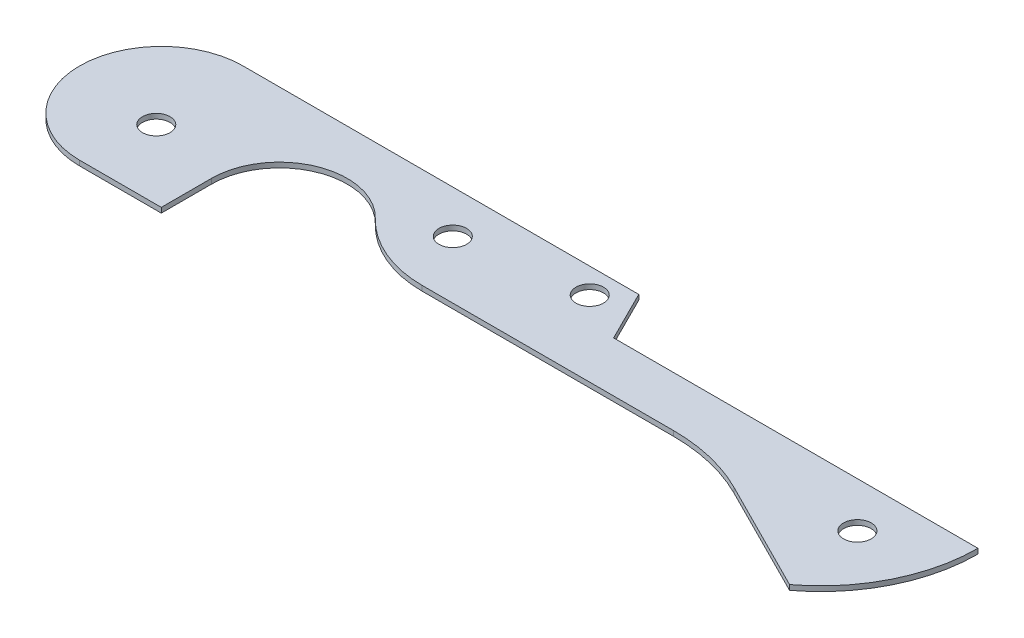
ISO-10303-21;
HEADER;
FILE_DESCRIPTION(('STEP AP214'),'2;1');
FILE_NAME('part.step','',(''),(''),'','','');
FILE_SCHEMA(('AUTOMOTIVE_DESIGN { 1 0 10303 214 1 1 1 1 }'));
ENDSEC;
DATA;
#1=APPLICATION_CONTEXT('core data for automotive mechanical design processes');
#2=APPLICATION_PROTOCOL_DEFINITION('international standard','automotive_design',2000,#1);
#3=PRODUCT_CONTEXT('',#1,'mechanical');
#4=PRODUCT('Part','Part','',(#3));
#5=PRODUCT_RELATED_PRODUCT_CATEGORY('part','',(#4));
#6=PRODUCT_DEFINITION_FORMATION('','',#4);
#7=PRODUCT_DEFINITION_CONTEXT('part definition',#1,'design');
#8=PRODUCT_DEFINITION('design','',#6,#7);
#9=PRODUCT_DEFINITION_SHAPE('','',#8);
#10=(LENGTH_UNIT() NAMED_UNIT(*) SI_UNIT(.MILLI.,.METRE.));
#11=(NAMED_UNIT(*) PLANE_ANGLE_UNIT() SI_UNIT($,.RADIAN.));
#12=(NAMED_UNIT(*) SI_UNIT($,.STERADIAN.) SOLID_ANGLE_UNIT());
#13=UNCERTAINTY_MEASURE_WITH_UNIT(LENGTH_MEASURE(1.E-05),#10,'distance_accuracy_value','');
#14=(GEOMETRIC_REPRESENTATION_CONTEXT(3) GLOBAL_UNCERTAINTY_ASSIGNED_CONTEXT((#13)) GLOBAL_UNIT_ASSIGNED_CONTEXT((#10,
#11,#12)) REPRESENTATION_CONTEXT('',''));
#15=CARTESIAN_POINT('',(0.,0.,0.));
#16=DIRECTION('',(0.,0.,1.));
#17=DIRECTION('',(1.,0.,0.));
#18=AXIS2_PLACEMENT_3D('',#15,#16,#17);
#19=CARTESIAN_POINT('',(0.,0.508,0.));
#20=DIRECTION('',(0.,-1.,0.));
#21=DIRECTION('',(0.,0.,-1.));
#22=AXIS2_PLACEMENT_3D('',#19,#20,#21);
#23=CYLINDRICAL_SURFACE('',#22,8.255);
#24=CARTESIAN_POINT('',(0.,0.,0.));
#25=DIRECTION('',(0.,1.,0.));
#26=DIRECTION('',(0.,0.,1.));
#27=AXIS2_PLACEMENT_3D('',#24,#25,#26);
#28=CIRCLE('',#27,8.255);
#29=CARTESIAN_POINT('',(0.,0.,-8.255));
#30=VERTEX_POINT('',#29);
#31=CARTESIAN_POINT('',(0.,0.,8.255));
#32=VERTEX_POINT('',#31);
#33=EDGE_CURVE('E168',#30,#32,#28,.T.);
#34=ORIENTED_EDGE('',*,*,#33,.T.);
#35=DIRECTION('',(0.,-1.,0.));
#36=VECTOR('',#35,1.);
#37=CARTESIAN_POINT('',(0.,0.508,8.255));
#38=LINE('',#37,#36);
#39=CARTESIAN_POINT('',(0.,0.508,8.255));
#40=VERTEX_POINT('',#39);
#41=EDGE_CURVE('E11',#40,#32,#38,.T.);
#42=ORIENTED_EDGE('',*,*,#41,.F.);
#43=CARTESIAN_POINT('',(0.,0.508,0.));
#44=DIRECTION('',(0.,1.,0.));
#45=DIRECTION('',(0.,0.,1.));
#46=AXIS2_PLACEMENT_3D('',#43,#44,#45);
#47=CIRCLE('',#46,8.255);
#48=CARTESIAN_POINT('',(0.,0.508,-8.255));
#49=VERTEX_POINT('',#48);
#50=EDGE_CURVE('E203',#49,#40,#47,.T.);
#51=ORIENTED_EDGE('',*,*,#50,.F.);
#52=DIRECTION('',(0.,-1.,0.));
#53=VECTOR('',#52,1.);
#54=CARTESIAN_POINT('',(0.,0.508,-8.255));
#55=LINE('',#54,#53);
#56=EDGE_CURVE('E164',#49,#30,#55,.T.);
#57=ORIENTED_EDGE('',*,*,#56,.T.);
#58=EDGE_LOOP('',(#34,#42,#51,#57));
#59=FACE_BOUND('',#58,.T.);
#60=ADVANCED_FACE('F42',(#59),#23,.T.);
#61=CARTESIAN_POINT('',(0.,0.508,8.255));
#62=DIRECTION('',(0.,0.,-1.));
#63=DIRECTION('',(-1.,0.,0.));
#64=AXIS2_PLACEMENT_3D('',#61,#62,#63);
#65=PLANE('',#64);
#66=DIRECTION('',(1.,0.,0.));
#67=VECTOR('',#66,1.);
#68=CARTESIAN_POINT('',(0.,0.,8.255));
#69=LINE('',#68,#67);
#70=CARTESIAN_POINT('',(8.255,0.,8.255));
#71=VERTEX_POINT('',#70);
#72=EDGE_CURVE('E172',#32,#71,#69,.T.);
#73=ORIENTED_EDGE('',*,*,#72,.T.);
#74=DIRECTION('',(0.,-1.,0.));
#75=VECTOR('',#74,1.);
#76=CARTESIAN_POINT('',(8.255,0.508,8.255));
#77=LINE('',#76,#75);
#78=CARTESIAN_POINT('',(8.255,0.508,8.255));
#79=VERTEX_POINT('',#78);
#80=EDGE_CURVE('E51',#79,#71,#77,.T.);
#81=ORIENTED_EDGE('',*,*,#80,.F.);
#82=DIRECTION('',(1.,0.,0.));
#83=VECTOR('',#82,1.);
#84=CARTESIAN_POINT('',(0.,0.508,8.255));
#85=LINE('',#84,#83);
#86=EDGE_CURVE('E114',#40,#79,#85,.T.);
#87=ORIENTED_EDGE('',*,*,#86,.F.);
#88=ORIENTED_EDGE('',*,*,#41,.T.);
#89=EDGE_LOOP('',(#73,#81,#87,#88));
#90=FACE_BOUND('',#89,.T.);
#91=ADVANCED_FACE('F305',(#90),#65,.F.);
#92=CARTESIAN_POINT('',(8.255,0.508,3.175));
#93=DIRECTION('',(-1.,0.,0.));
#94=DIRECTION('',(0.,0.,1.));
#95=AXIS2_PLACEMENT_3D('',#92,#93,#94);
#96=PLANE('',#95);
#97=DIRECTION('',(0.,0.,-1.));
#98=VECTOR('',#97,1.);
#99=CARTESIAN_POINT('',(8.255,0.,3.175));
#100=LINE('',#99,#98);
#101=CARTESIAN_POINT('',(8.255,0.,3.175));
#102=VERTEX_POINT('',#101);
#103=EDGE_CURVE('E176',#71,#102,#100,.T.);
#104=ORIENTED_EDGE('',*,*,#103,.T.);
#105=DIRECTION('',(0.,-1.,0.));
#106=VECTOR('',#105,1.);
#107=CARTESIAN_POINT('',(8.255,0.508,3.175));
#108=LINE('',#107,#106);
#109=CARTESIAN_POINT('',(8.255,0.508,3.175));
#110=VERTEX_POINT('',#109);
#111=EDGE_CURVE('E230',#110,#102,#108,.T.);
#112=ORIENTED_EDGE('',*,*,#111,.F.);
#113=DIRECTION('',(0.,0.,-1.));
#114=VECTOR('',#113,1.);
#115=CARTESIAN_POINT('',(8.255,0.508,3.175));
#116=LINE('',#115,#114);
#117=EDGE_CURVE('E241',#79,#110,#116,.T.);
#118=ORIENTED_EDGE('',*,*,#117,.F.);
#119=ORIENTED_EDGE('',*,*,#80,.T.);
#120=EDGE_LOOP('',(#104,#112,#118,#119));
#121=FACE_BOUND('',#120,.T.);
#122=ADVANCED_FACE('F239',(#121),#96,.F.);
#123=CARTESIAN_POINT('',(15.1129999999941,0.508,3.175));
#124=DIRECTION('',(0.,-1.,0.));
#125=DIRECTION('',(0.,0.,-1.));
#126=AXIS2_PLACEMENT_3D('',#123,#124,#125);
#127=CYLINDRICAL_SURFACE('',#126,6.85799999999405);
#128=CARTESIAN_POINT('',(15.1129999999941,0.,3.175));
#129=DIRECTION('',(0.,-1.,0.));
#130=DIRECTION('',(0.,0.,1.));
#131=AXIS2_PLACEMENT_3D('',#128,#129,#130);
#132=CIRCLE('',#131,6.85799999999405);
#133=CARTESIAN_POINT('',(20.0476486956909,0.,-1.58749999999742));
#134=VERTEX_POINT('',#133);
#135=EDGE_CURVE('E179',#102,#134,#132,.T.);
#136=ORIENTED_EDGE('',*,*,#135,.T.);
#137=DIRECTION('',(0.,-1.,0.));
#138=VECTOR('',#137,1.);
#139=CARTESIAN_POINT('',(20.0476486956909,0.508,-1.58749999999742));
#140=LINE('',#139,#138);
#141=CARTESIAN_POINT('',(20.0476486956909,0.508,-1.58749999999742));
#142=VERTEX_POINT('',#141);
#143=EDGE_CURVE('E226',#142,#134,#140,.T.);
#144=ORIENTED_EDGE('',*,*,#143,.F.);
#145=CARTESIAN_POINT('',(15.1129999999941,0.508,3.175));
#146=DIRECTION('',(0.,-1.,0.));
#147=DIRECTION('',(0.,0.,1.));
#148=AXIS2_PLACEMENT_3D('',#145,#146,#147);
#149=CIRCLE('',#148,6.85799999999405);
#150=EDGE_CURVE('E260',#110,#142,#149,.T.);
#151=ORIENTED_EDGE('',*,*,#150,.F.);
#152=ORIENTED_EDGE('',*,*,#111,.T.);
#153=EDGE_LOOP('',(#136,#144,#151,#152));
#154=FACE_BOUND('',#153,.T.);
#155=ADVANCED_FACE('F250',(#154),#127,.F.);
#156=CARTESIAN_POINT('',(28.2720631885262,0.508,-9.525));
#157=DIRECTION('',(0.,-1.,0.));
#158=DIRECTION('',(0.,0.,-1.));
#159=AXIS2_PLACEMENT_3D('',#156,#157,#158);
#160=CYLINDRICAL_SURFACE('',#159,11.43);
#161=CARTESIAN_POINT('',(28.2720631885262,0.,-9.525));
#162=DIRECTION('',(0.,1.,0.));
#163=DIRECTION('',(0.,0.,-1.));
#164=AXIS2_PLACEMENT_3D('',#161,#162,#163);
#165=CIRCLE('',#164,11.43);
#166=CARTESIAN_POINT('',(28.2720631885262,0.,1.905));
#167=VERTEX_POINT('',#166);
#168=EDGE_CURVE('E182',#134,#167,#165,.T.);
#169=ORIENTED_EDGE('',*,*,#168,.T.);
#170=DIRECTION('',(0.,-1.,0.));
#171=VECTOR('',#170,1.);
#172=CARTESIAN_POINT('',(28.2720631885262,0.508,1.905));
#173=LINE('',#172,#171);
#174=CARTESIAN_POINT('',(28.2720631885262,0.508,1.905));
#175=VERTEX_POINT('',#174);
#176=EDGE_CURVE('E222',#175,#167,#173,.T.);
#177=ORIENTED_EDGE('',*,*,#176,.F.);
#178=CARTESIAN_POINT('',(28.2720631885262,0.508,-9.525));
#179=DIRECTION('',(0.,1.,0.));
#180=DIRECTION('',(0.,0.,-1.));
#181=AXIS2_PLACEMENT_3D('',#178,#179,#180);
#182=CIRCLE('',#181,11.43);
#183=EDGE_CURVE('E256',#142,#175,#182,.T.);
#184=ORIENTED_EDGE('',*,*,#183,.F.);
#185=ORIENTED_EDGE('',*,*,#143,.T.);
#186=EDGE_LOOP('',(#169,#177,#184,#185));
#187=FACE_BOUND('',#186,.T.);
#188=ADVANCED_FACE('F254',(#187),#160,.T.);
#189=CARTESIAN_POINT('',(53.6720631885262,0.508,1.905));
#190=DIRECTION('',(0.,0.,-1.));
#191=DIRECTION('',(-1.,0.,0.));
#192=AXIS2_PLACEMENT_3D('',#189,#190,#191);
#193=PLANE('',#192);
#194=DIRECTION('',(1.,0.,0.));
#195=VECTOR('',#194,1.);
#196=CARTESIAN_POINT('',(53.6720631885262,0.,1.905));
#197=LINE('',#196,#195);
#198=CARTESIAN_POINT('',(53.6720631885262,0.,1.905));
#199=VERTEX_POINT('',#198);
#200=EDGE_CURVE('E185',#167,#199,#197,.T.);
#201=ORIENTED_EDGE('',*,*,#200,.T.);
#202=DIRECTION('',(0.,-1.,0.));
#203=VECTOR('',#202,1.);
#204=CARTESIAN_POINT('',(53.6720631885262,0.508,1.905));
#205=LINE('',#204,#203);
#206=CARTESIAN_POINT('',(53.6720631885262,0.508,1.905));
#207=VERTEX_POINT('',#206);
#208=EDGE_CURVE('E218',#207,#199,#205,.T.);
#209=ORIENTED_EDGE('',*,*,#208,.F.);
#210=DIRECTION('',(1.,0.,0.));
#211=VECTOR('',#210,1.);
#212=CARTESIAN_POINT('',(53.6720631885262,0.508,1.905));
#213=LINE('',#212,#211);
#214=EDGE_CURVE('E259',#175,#207,#213,.T.);
#215=ORIENTED_EDGE('',*,*,#214,.F.);
#216=ORIENTED_EDGE('',*,*,#176,.T.);
#217=EDGE_LOOP('',(#201,#209,#215,#216));
#218=FACE_BOUND('',#217,.T.);
#219=ADVANCED_FACE('F318',(#218),#193,.F.);
#220=CARTESIAN_POINT('',(53.6809351485243,0.508,19.6849977865107));
#221=DIRECTION('',(0.,-1.,0.));
#222=DIRECTION('',(0.,0.,-1.));
#223=AXIS2_PLACEMENT_3D('',#220,#221,#222);
#224=CYLINDRICAL_SURFACE('',#223,17.78);
#225=CARTESIAN_POINT('',(53.6809351485243,0.,19.6849977865107));
#226=DIRECTION('',(0.,-1.,0.));
#227=DIRECTION('',(0.,0.,1.));
#228=AXIS2_PLACEMENT_3D('',#225,#226,#227);
#229=CIRCLE('',#228,17.78);
#230=CARTESIAN_POINT('',(61.6844385970978,0.,3.80821182244755));
#231=VERTEX_POINT('',#230);
#232=EDGE_CURVE('E188',#199,#231,#229,.T.);
#233=ORIENTED_EDGE('',*,*,#232,.T.);
#234=DIRECTION('',(0.,-1.,0.));
#235=VECTOR('',#234,1.);
#236=CARTESIAN_POINT('',(61.6844385970978,0.508,3.80821182244755));
#237=LINE('',#236,#235);
#238=CARTESIAN_POINT('',(61.6844385970978,0.508,3.80821182244755));
#239=VERTEX_POINT('',#238);
#240=EDGE_CURVE('E214',#239,#231,#237,.T.);
#241=ORIENTED_EDGE('',*,*,#240,.F.);
#242=CARTESIAN_POINT('',(53.6809351485243,0.508,19.6849977865107));
#243=DIRECTION('',(0.,-1.,0.));
#244=DIRECTION('',(0.,0.,1.));
#245=AXIS2_PLACEMENT_3D('',#242,#243,#244);
#246=CIRCLE('',#245,17.78);
#247=EDGE_CURVE('E265',#207,#239,#246,.T.);
#248=ORIENTED_EDGE('',*,*,#247,.F.);
#249=ORIENTED_EDGE('',*,*,#208,.T.);
#250=EDGE_LOOP('',(#233,#241,#248,#249));
#251=FACE_BOUND('',#250,.T.);
#252=ADVANCED_FACE('F321',(#251),#224,.F.);
#253=CARTESIAN_POINT('',(73.025,0.508,9.525));
#254=DIRECTION('',(0.450140801382083,0.,-0.892957590779706));
#255=DIRECTION('',(-0.892957590779705,0.,-0.450140801382083));
#256=AXIS2_PLACEMENT_3D('',#253,#254,#255);
#257=PLANE('',#256);
#258=DIRECTION('',(0.892957590779705,0.,0.450140801382083));
#259=VECTOR('',#258,1.);
#260=CARTESIAN_POINT('',(73.025,0.,9.525));
#261=LINE('',#260,#259);
#262=CARTESIAN_POINT('',(73.025,0.,9.525));
#263=VERTEX_POINT('',#262);
#264=EDGE_CURVE('E191',#231,#263,#261,.T.);
#265=ORIENTED_EDGE('',*,*,#264,.T.);
#266=DIRECTION('',(0.,-1.,0.));
#267=VECTOR('',#266,1.);
#268=CARTESIAN_POINT('',(73.025,0.508,9.525));
#269=LINE('',#268,#267);
#270=CARTESIAN_POINT('',(73.025,0.508,9.525));
#271=VERTEX_POINT('',#270);
#272=EDGE_CURVE('E210',#271,#263,#269,.T.);
#273=ORIENTED_EDGE('',*,*,#272,.F.);
#274=DIRECTION('',(0.892957590779705,0.,0.450140801382083));
#275=VECTOR('',#274,1.);
#276=CARTESIAN_POINT('',(73.025,0.508,9.525));
#277=LINE('',#276,#275);
#278=EDGE_CURVE('E272',#239,#271,#277,.T.);
#279=ORIENTED_EDGE('',*,*,#278,.F.);
#280=ORIENTED_EDGE('',*,*,#240,.T.);
#281=EDGE_LOOP('',(#265,#273,#279,#280));
#282=FACE_BOUND('',#281,.T.);
#283=ADVANCED_FACE('F285',(#282),#257,.F.);
#284=CARTESIAN_POINT('',(63.5,0.508,-3.175));
#285=DIRECTION('',(0.,-1.,0.));
#286=DIRECTION('',(0.,0.,-1.));
#287=AXIS2_PLACEMENT_3D('',#284,#285,#286);
#288=CYLINDRICAL_SURFACE('',#287,15.875);
#289=CARTESIAN_POINT('',(63.5,0.,-3.175));
#290=DIRECTION('',(0.,1.,0.));
#291=DIRECTION('',(0.,0.,-1.));
#292=AXIS2_PLACEMENT_3D('',#289,#290,#291);
#293=CIRCLE('',#292,15.875);
#294=CARTESIAN_POINT('',(79.375,0.,-3.175));
#295=VERTEX_POINT('',#294);
#296=EDGE_CURVE('E194',#263,#295,#293,.T.);
#297=ORIENTED_EDGE('',*,*,#296,.T.);
#298=DIRECTION('',(0.,-1.,0.));
#299=VECTOR('',#298,1.);
#300=CARTESIAN_POINT('',(79.375,0.508,-3.175));
#301=LINE('',#300,#299);
#302=CARTESIAN_POINT('',(79.375,0.508,-3.175));
#303=VERTEX_POINT('',#302);
#304=EDGE_CURVE('E156',#303,#295,#301,.T.);
#305=ORIENTED_EDGE('',*,*,#304,.F.);
#306=CARTESIAN_POINT('',(63.5,0.508,-3.175));
#307=DIRECTION('',(0.,1.,0.));
#308=DIRECTION('',(0.,0.,-1.));
#309=AXIS2_PLACEMENT_3D('',#306,#307,#308);
#310=CIRCLE('',#309,15.875);
#311=EDGE_CURVE('E145',#271,#303,#310,.T.);
#312=ORIENTED_EDGE('',*,*,#311,.F.);
#313=ORIENTED_EDGE('',*,*,#272,.T.);
#314=EDGE_LOOP('',(#297,#305,#312,#313));
#315=FACE_BOUND('',#314,.T.);
#316=ADVANCED_FACE('F289',(#315),#288,.T.);
#317=CARTESIAN_POINT('',(42.545,0.508,-3.175));
#318=DIRECTION('',(0.,0.,1.));
#319=DIRECTION('',(1.,0.,0.));
#320=AXIS2_PLACEMENT_3D('',#317,#318,#319);
#321=PLANE('',#320);
#322=DIRECTION('',(-1.,0.,0.));
#323=VECTOR('',#322,1.);
#324=CARTESIAN_POINT('',(42.545,0.,-3.175));
#325=LINE('',#324,#323);
#326=CARTESIAN_POINT('',(42.545,0.,-3.175));
#327=VERTEX_POINT('',#326);
#328=EDGE_CURVE('E154',#295,#327,#325,.T.);
#329=ORIENTED_EDGE('',*,*,#328,.T.);
#330=DIRECTION('',(0.,-1.,0.));
#331=VECTOR('',#330,1.);
#332=CARTESIAN_POINT('',(42.545,0.508,-3.175));
#333=LINE('',#332,#331);
#334=CARTESIAN_POINT('',(42.545,0.508,-3.175));
#335=VERTEX_POINT('',#334);
#336=EDGE_CURVE('E151',#335,#327,#333,.T.);
#337=ORIENTED_EDGE('',*,*,#336,.F.);
#338=DIRECTION('',(-1.,0.,0.));
#339=VECTOR('',#338,1.);
#340=CARTESIAN_POINT('',(42.545,0.508,-3.175));
#341=LINE('',#340,#339);
#342=EDGE_CURVE('E139',#303,#335,#341,.T.);
#343=ORIENTED_EDGE('',*,*,#342,.F.);
#344=ORIENTED_EDGE('',*,*,#304,.T.);
#345=EDGE_LOOP('',(#329,#337,#343,#344));
#346=FACE_BOUND('',#345,.T.);
#347=ADVANCED_FACE('F152',(#346),#321,.F.);
#348=CARTESIAN_POINT('',(40.005,0.508,-8.255));
#349=DIRECTION('',(-0.894427190999915,0.,0.447213595499959));
#350=DIRECTION('',(0.447213595499959,0.,0.894427190999915));
#351=AXIS2_PLACEMENT_3D('',#348,#349,#350);
#352=PLANE('',#351);
#353=DIRECTION('',(-0.447213595499959,0.,-0.894427190999915));
#354=VECTOR('',#353,1.);
#355=CARTESIAN_POINT('',(40.005,0.,-8.255));
#356=LINE('',#355,#354);
#357=CARTESIAN_POINT('',(40.005,0.,-8.255));
#358=VERTEX_POINT('',#357);
#359=EDGE_CURVE('E100',#327,#358,#356,.T.);
#360=ORIENTED_EDGE('',*,*,#359,.T.);
#361=DIRECTION('',(0.,-1.,0.));
#362=VECTOR('',#361,1.);
#363=CARTESIAN_POINT('',(40.005,0.508,-8.255));
#364=LINE('',#363,#362);
#365=CARTESIAN_POINT('',(40.005,0.508,-8.255));
#366=VERTEX_POINT('',#365);
#367=EDGE_CURVE('E157',#366,#358,#364,.T.);
#368=ORIENTED_EDGE('',*,*,#367,.F.);
#369=DIRECTION('',(-0.447213595499959,0.,-0.894427190999915));
#370=VECTOR('',#369,1.);
#371=CARTESIAN_POINT('',(40.005,0.508,-8.255));
#372=LINE('',#371,#370);
#373=EDGE_CURVE('E143',#335,#366,#372,.T.);
#374=ORIENTED_EDGE('',*,*,#373,.F.);
#375=ORIENTED_EDGE('',*,*,#336,.T.);
#376=EDGE_LOOP('',(#360,#368,#374,#375));
#377=FACE_BOUND('',#376,.T.);
#378=ADVANCED_FACE('F159',(#377),#352,.F.);
#379=CARTESIAN_POINT('',(0.,0.508,-8.255));
#380=DIRECTION('',(0.,0.,1.));
#381=DIRECTION('',(1.,0.,0.));
#382=AXIS2_PLACEMENT_3D('',#379,#380,#381);
#383=PLANE('',#382);
#384=DIRECTION('',(-1.,0.,0.));
#385=VECTOR('',#384,1.);
#386=CARTESIAN_POINT('',(0.,0.,-8.255));
#387=LINE('',#386,#385);
#388=EDGE_CURVE('E106',#358,#30,#387,.T.);
#389=ORIENTED_EDGE('',*,*,#388,.T.);
#390=ORIENTED_EDGE('',*,*,#56,.F.);
#391=DIRECTION('',(-1.,0.,0.));
#392=VECTOR('',#391,1.);
#393=CARTESIAN_POINT('',(0.,0.508,-8.255));
#394=LINE('',#393,#392);
#395=EDGE_CURVE('E59',#366,#49,#394,.T.);
#396=ORIENTED_EDGE('',*,*,#395,.F.);
#397=ORIENTED_EDGE('',*,*,#367,.T.);
#398=EDGE_LOOP('',(#389,#390,#396,#397));
#399=FACE_BOUND('',#398,.T.);
#400=ADVANCED_FACE('F293',(#399),#383,.F.);
#401=CARTESIAN_POINT('',(0.,0.508,0.));
#402=DIRECTION('',(0.,1.,0.));
#403=DIRECTION('',(0.,0.,1.));
#404=AXIS2_PLACEMENT_3D('',#401,#402,#403);
#405=PLANE('',#404);
#406=CARTESIAN_POINT('',(0.762000000000001,0.508,1.27));
#407=DIRECTION('',(0.,1.,0.));
#408=DIRECTION('',(0.,0.,1.));
#409=AXIS2_PLACEMENT_3D('',#406,#407,#408);
#410=CIRCLE('',#409,1.397);
#411=CARTESIAN_POINT('',(0.762000000000001,0.508,2.667));
#412=VERTEX_POINT('',#411);
#413=EDGE_CURVE('E492',#412,#412,#410,.T.);
#414=ORIENTED_EDGE('',*,*,#413,.F.);
#415=EDGE_LOOP('',(#414));
#416=FACE_BOUND('',#415,.T.);
#417=CARTESIAN_POINT('',(25.527,0.508,-3.937));
#418=DIRECTION('',(0.,1.,0.));
#419=DIRECTION('',(0.,0.,1.));
#420=AXIS2_PLACEMENT_3D('',#417,#418,#419);
#421=CIRCLE('',#420,1.397);
#422=CARTESIAN_POINT('',(25.527,0.508,-2.54));
#423=VERTEX_POINT('',#422);
#424=EDGE_CURVE('E501',#423,#423,#421,.T.);
#425=ORIENTED_EDGE('',*,*,#424,.F.);
#426=EDGE_LOOP('',(#425));
#427=FACE_BOUND('',#426,.T.);
#428=CARTESIAN_POINT('',(37.592,0.508,-5.715));
#429=DIRECTION('',(0.,1.,0.));
#430=DIRECTION('',(0.,0.,1.));
#431=AXIS2_PLACEMENT_3D('',#428,#429,#430);
#432=CIRCLE('',#431,1.39700000000001);
#433=CARTESIAN_POINT('',(37.592,0.508,-4.31799999999999));
#434=VERTEX_POINT('',#433);
#435=EDGE_CURVE('E511',#434,#434,#432,.T.);
#436=ORIENTED_EDGE('',*,*,#435,.F.);
#437=EDGE_LOOP('',(#436));
#438=FACE_BOUND('',#437,.T.);
#439=CARTESIAN_POINT('',(71.755,0.508,1.397));
#440=DIRECTION('',(0.,1.,0.));
#441=DIRECTION('',(0.,0.,1.));
#442=AXIS2_PLACEMENT_3D('',#439,#440,#441);
#443=CIRCLE('',#442,1.39699999999999);
#444=CARTESIAN_POINT('',(71.755,0.508,2.79399999999999));
#445=VERTEX_POINT('',#444);
#446=EDGE_CURVE('E519',#445,#445,#443,.T.);
#447=ORIENTED_EDGE('',*,*,#446,.F.);
#448=EDGE_LOOP('',(#447));
#449=FACE_BOUND('',#448,.T.);
#450=ORIENTED_EDGE('',*,*,#50,.T.);
#451=ORIENTED_EDGE('',*,*,#86,.T.);
#452=ORIENTED_EDGE('',*,*,#117,.T.);
#453=ORIENTED_EDGE('',*,*,#150,.T.);
#454=ORIENTED_EDGE('',*,*,#183,.T.);
#455=ORIENTED_EDGE('',*,*,#214,.T.);
#456=ORIENTED_EDGE('',*,*,#247,.T.);
#457=ORIENTED_EDGE('',*,*,#278,.T.);
#458=ORIENTED_EDGE('',*,*,#311,.T.);
#459=ORIENTED_EDGE('',*,*,#342,.T.);
#460=ORIENTED_EDGE('',*,*,#373,.T.);
#461=ORIENTED_EDGE('',*,*,#395,.T.);
#462=EDGE_LOOP('',(#450,#451,#452,#453,#454,#455,#456,#457,#458,#459,#460,#461));
#463=FACE_BOUND('',#462,.T.);
#464=ADVANCED_FACE('F141',(#416,#427,#438,#449,#463),#405,.T.);
#465=CARTESIAN_POINT('',(0.,0.,0.));
#466=DIRECTION('',(0.,1.,0.));
#467=DIRECTION('',(0.,0.,1.));
#468=AXIS2_PLACEMENT_3D('',#465,#466,#467);
#469=PLANE('',#468);
#470=CARTESIAN_POINT('',(0.762000000000001,0.,1.27));
#471=DIRECTION('',(0.,1.,0.));
#472=DIRECTION('',(0.,0.,1.));
#473=AXIS2_PLACEMENT_3D('',#470,#471,#472);
#474=CIRCLE('',#473,1.397);
#475=CARTESIAN_POINT('',(0.762000000000001,0.,2.667));
#476=VERTEX_POINT('',#475);
#477=EDGE_CURVE('E173',#476,#476,#474,.T.);
#478=ORIENTED_EDGE('',*,*,#477,.T.);
#479=EDGE_LOOP('',(#478));
#480=FACE_BOUND('',#479,.T.);
#481=CARTESIAN_POINT('',(25.527,0.,-3.937));
#482=DIRECTION('',(0.,1.,0.));
#483=DIRECTION('',(0.,0.,1.));
#484=AXIS2_PLACEMENT_3D('',#481,#482,#483);
#485=CIRCLE('',#484,1.397);
#486=CARTESIAN_POINT('',(25.527,0.,-2.54));
#487=VERTEX_POINT('',#486);
#488=EDGE_CURVE('E494',#487,#487,#485,.T.);
#489=ORIENTED_EDGE('',*,*,#488,.T.);
#490=EDGE_LOOP('',(#489));
#491=FACE_BOUND('',#490,.T.);
#492=CARTESIAN_POINT('',(37.592,0.,-5.715));
#493=DIRECTION('',(0.,1.,0.));
#494=DIRECTION('',(0.,0.,1.));
#495=AXIS2_PLACEMENT_3D('',#492,#493,#494);
#496=CIRCLE('',#495,1.39700000000001);
#497=CARTESIAN_POINT('',(37.592,0.,-4.31799999999999));
#498=VERTEX_POINT('',#497);
#499=EDGE_CURVE('E507',#498,#498,#496,.T.);
#500=ORIENTED_EDGE('',*,*,#499,.T.);
#501=EDGE_LOOP('',(#500));
#502=FACE_BOUND('',#501,.T.);
#503=CARTESIAN_POINT('',(71.755,0.,1.397));
#504=DIRECTION('',(0.,1.,0.));
#505=DIRECTION('',(0.,0.,1.));
#506=AXIS2_PLACEMENT_3D('',#503,#504,#505);
#507=CIRCLE('',#506,1.39699999999999);
#508=CARTESIAN_POINT('',(71.755,0.,2.79399999999999));
#509=VERTEX_POINT('',#508);
#510=EDGE_CURVE('E515',#509,#509,#507,.T.);
#511=ORIENTED_EDGE('',*,*,#510,.T.);
#512=EDGE_LOOP('',(#511));
#513=FACE_BOUND('',#512,.T.);
#514=ORIENTED_EDGE('',*,*,#33,.F.);
#515=ORIENTED_EDGE('',*,*,#388,.F.);
#516=ORIENTED_EDGE('',*,*,#359,.F.);
#517=ORIENTED_EDGE('',*,*,#328,.F.);
#518=ORIENTED_EDGE('',*,*,#296,.F.);
#519=ORIENTED_EDGE('',*,*,#264,.F.);
#520=ORIENTED_EDGE('',*,*,#232,.F.);
#521=ORIENTED_EDGE('',*,*,#200,.F.);
#522=ORIENTED_EDGE('',*,*,#168,.F.);
#523=ORIENTED_EDGE('',*,*,#135,.F.);
#524=ORIENTED_EDGE('',*,*,#103,.F.);
#525=ORIENTED_EDGE('',*,*,#72,.F.);
#526=EDGE_LOOP('',(#514,#515,#516,#517,#518,#519,#520,#521,#522,#523,#524,#525));
#527=FACE_BOUND('',#526,.T.);
#528=ADVANCED_FACE('F245',(#480,#491,#502,#513,#527),#469,.F.);
#529=CARTESIAN_POINT('',(71.755,0.,1.397));
#530=DIRECTION('',(0.,1.,0.));
#531=DIRECTION('',(0.,0.,1.));
#532=AXIS2_PLACEMENT_3D('',#529,#530,#531);
#533=CYLINDRICAL_SURFACE('',#532,1.39699999999999);
#534=ORIENTED_EDGE('',*,*,#510,.F.);
#535=EDGE_LOOP('',(#534));
#536=FACE_BOUND('',#535,.T.);
#537=ORIENTED_EDGE('',*,*,#446,.T.);
#538=EDGE_LOOP('',(#537));
#539=FACE_BOUND('',#538,.T.);
#540=ADVANCED_FACE('F358',(#536,#539),#533,.F.);
#541=CARTESIAN_POINT('',(37.592,0.,-5.715));
#542=DIRECTION('',(0.,1.,0.));
#543=DIRECTION('',(0.,0.,1.));
#544=AXIS2_PLACEMENT_3D('',#541,#542,#543);
#545=CYLINDRICAL_SURFACE('',#544,1.39700000000001);
#546=ORIENTED_EDGE('',*,*,#499,.F.);
#547=EDGE_LOOP('',(#546));
#548=FACE_BOUND('',#547,.T.);
#549=ORIENTED_EDGE('',*,*,#435,.T.);
#550=EDGE_LOOP('',(#549));
#551=FACE_BOUND('',#550,.T.);
#552=ADVANCED_FACE('F367',(#548,#551),#545,.F.);
#553=CARTESIAN_POINT('',(25.527,0.,-3.937));
#554=DIRECTION('',(0.,1.,0.));
#555=DIRECTION('',(0.,0.,1.));
#556=AXIS2_PLACEMENT_3D('',#553,#554,#555);
#557=CYLINDRICAL_SURFACE('',#556,1.397);
#558=ORIENTED_EDGE('',*,*,#488,.F.);
#559=EDGE_LOOP('',(#558));
#560=FACE_BOUND('',#559,.T.);
#561=ORIENTED_EDGE('',*,*,#424,.T.);
#562=EDGE_LOOP('',(#561));
#563=FACE_BOUND('',#562,.T.);
#564=ADVANCED_FACE('F377',(#560,#563),#557,.F.);
#565=CARTESIAN_POINT('',(0.762000000000001,0.,1.27));
#566=DIRECTION('',(0.,1.,0.));
#567=DIRECTION('',(0.,0.,1.));
#568=AXIS2_PLACEMENT_3D('',#565,#566,#567);
#569=CYLINDRICAL_SURFACE('',#568,1.397);
#570=ORIENTED_EDGE('',*,*,#477,.F.);
#571=EDGE_LOOP('',(#570));
#572=FACE_BOUND('',#571,.T.);
#573=ORIENTED_EDGE('',*,*,#413,.T.);
#574=EDGE_LOOP('',(#573));
#575=FACE_BOUND('',#574,.T.);
#576=ADVANCED_FACE('F387',(#572,#575),#569,.F.);
#577=CLOSED_SHELL('',(#60,#91,#122,#155,#188,#219,#252,#283,#316,#347,#378,#400,#464,#528,#540,
#552,#564,#576));
#578=MANIFOLD_SOLID_BREP('B2',#577);
#579=ADVANCED_BREP_SHAPE_REPRESENTATION('',(#18,#578),#14);
#580=SHAPE_DEFINITION_REPRESENTATION(#9,#579);
ENDSEC;
END-ISO-10303-21;
